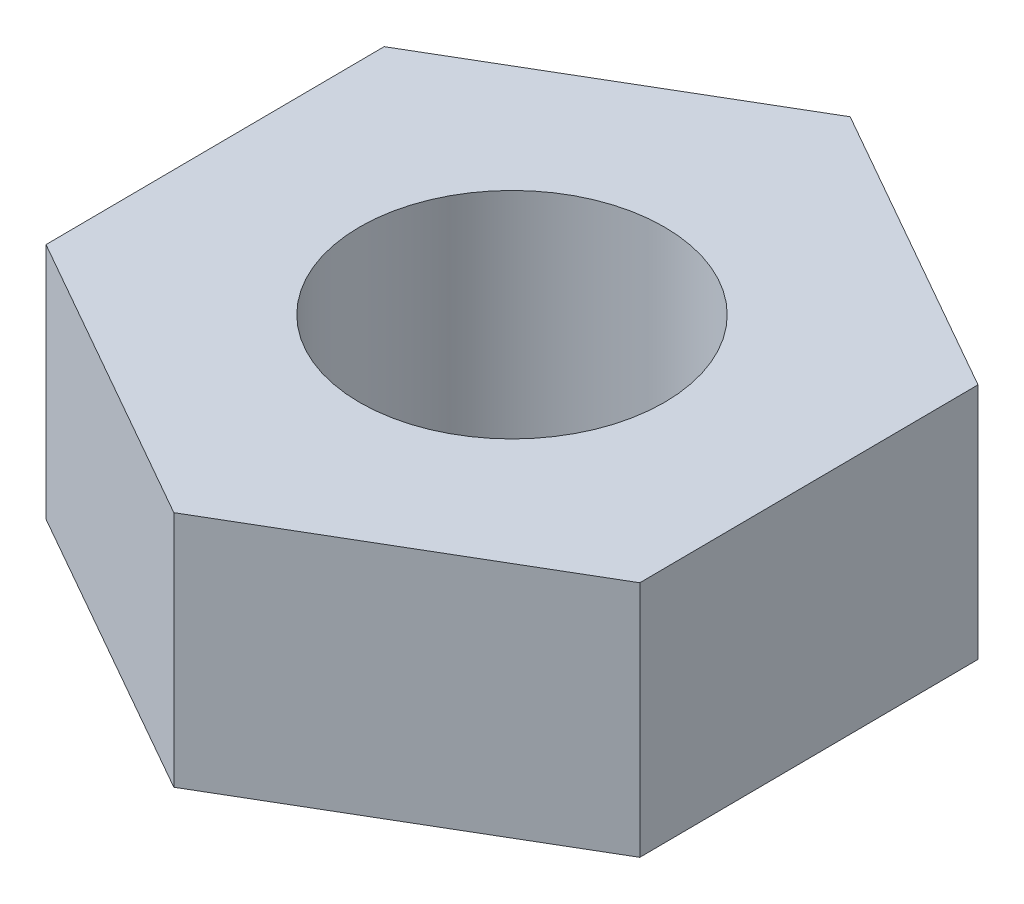
ISO-10303-21;
HEADER;
FILE_DESCRIPTION(('STEP AP214'),'2;1');
FILE_NAME('part.step','',(''),(''),'','','');
FILE_SCHEMA(('AUTOMOTIVE_DESIGN { 1 0 10303 214 1 1 1 1 }'));
ENDSEC;
DATA;
#1=APPLICATION_CONTEXT('core data for automotive mechanical design processes');
#2=APPLICATION_PROTOCOL_DEFINITION('international standard','automotive_design',2000,#1);
#3=PRODUCT_CONTEXT('',#1,'mechanical');
#4=PRODUCT('Part','Part','',(#3));
#5=PRODUCT_RELATED_PRODUCT_CATEGORY('part','',(#4));
#6=PRODUCT_DEFINITION_FORMATION('','',#4);
#7=PRODUCT_DEFINITION_CONTEXT('part definition',#1,'design');
#8=PRODUCT_DEFINITION('design','',#6,#7);
#9=PRODUCT_DEFINITION_SHAPE('','',#8);
#10=(LENGTH_UNIT() NAMED_UNIT(*) SI_UNIT(.MILLI.,.METRE.));
#11=(NAMED_UNIT(*) PLANE_ANGLE_UNIT() SI_UNIT($,.RADIAN.));
#12=(NAMED_UNIT(*) SI_UNIT($,.STERADIAN.) SOLID_ANGLE_UNIT());
#13=UNCERTAINTY_MEASURE_WITH_UNIT(LENGTH_MEASURE(1.E-05),#10,'distance_accuracy_value','');
#14=(GEOMETRIC_REPRESENTATION_CONTEXT(3) GLOBAL_UNCERTAINTY_ASSIGNED_CONTEXT((#13)) GLOBAL_UNIT_ASSIGNED_CONTEXT((#10,
#11,#12)) REPRESENTATION_CONTEXT('',''));
#15=CARTESIAN_POINT('',(0.,0.,0.));
#16=DIRECTION('',(0.,0.,1.));
#17=DIRECTION('',(1.,0.,0.));
#18=AXIS2_PLACEMENT_3D('',#15,#16,#17);
#19=CARTESIAN_POINT('',(3.89035270259153,3.125,2.21042737559322));
#20=DIRECTION('',(0.,-1.,0.));
#21=DIRECTION('',(0.,0.,-1.));
#22=AXIS2_PLACEMENT_3D('',#19,#20,#21);
#23=PLANE('',#22);
#24=DIRECTION('',(-0.00690363957882424,0.,-0.999976169596339));
#25=VECTOR('',#24,1.);
#26=CARTESIAN_POINT('',(3.89035270259153,3.125,2.21042737559322));
#27=LINE('',#26,#25);
#28=CARTESIAN_POINT('',(3.89035270259153,3.125,2.21042737559322));
#29=VERTEX_POINT('',#28);
#30=CARTESIAN_POINT('',(3.85946261178006,3.125,-2.2639305823291));
#31=VERTEX_POINT('',#30);
#32=EDGE_CURVE('E118',#29,#31,#27,.T.);
#33=ORIENTED_EDGE('',*,*,#32,.T.);
#34=DIRECTION('',(-0.869456585838897,0.,-0.494009357544337));
#35=VECTOR('',#34,1.);
#36=CARTESIAN_POINT('',(3.85946261178006,3.125,-2.2639305823291));
#37=LINE('',#36,#35);
#38=CARTESIAN_POINT('',(-0.0308900908114723,3.125,-4.47435795792232));
#39=VERTEX_POINT('',#38);
#40=EDGE_CURVE('E99',#31,#39,#37,.T.);
#41=ORIENTED_EDGE('',*,*,#40,.T.);
#42=DIRECTION('',(-0.862552946260073,0.,0.505966812052003));
#43=VECTOR('',#42,1.);
#44=CARTESIAN_POINT('',(-0.0308900908114723,3.125,-4.47435795792232));
#45=LINE('',#44,#43);
#46=CARTESIAN_POINT('',(-3.89035270259153,3.125,-2.21042737559322));
#47=VERTEX_POINT('',#46);
#48=EDGE_CURVE('E121',#39,#47,#45,.T.);
#49=ORIENTED_EDGE('',*,*,#48,.T.);
#50=DIRECTION('',(0.00690363957882444,0.,0.999976169596339));
#51=VECTOR('',#50,1.);
#52=CARTESIAN_POINT('',(-3.89035270259153,3.125,-2.21042737559322));
#53=LINE('',#52,#51);
#54=CARTESIAN_POINT('',(-3.85946261178006,3.125,2.2639305823291));
#55=VERTEX_POINT('',#54);
#56=EDGE_CURVE('E123',#47,#55,#53,.T.);
#57=ORIENTED_EDGE('',*,*,#56,.T.);
#58=DIRECTION('',(0.869456585838897,0.,0.494009357544337));
#59=VECTOR('',#58,1.);
#60=CARTESIAN_POINT('',(-3.85946261178006,3.125,2.2639305823291));
#61=LINE('',#60,#59);
#62=CARTESIAN_POINT('',(0.0308900908114716,3.125,4.47435795792233));
#63=VERTEX_POINT('',#62);
#64=EDGE_CURVE('E52',#55,#63,#61,.T.);
#65=ORIENTED_EDGE('',*,*,#64,.T.);
#66=DIRECTION('',(0.862552946260074,0.,-0.505966812052003));
#67=VECTOR('',#66,1.);
#68=CARTESIAN_POINT('',(0.0308900908114716,3.125,4.47435795792233));
#69=LINE('',#68,#67);
#70=EDGE_CURVE('E47',#63,#29,#69,.T.);
#71=ORIENTED_EDGE('',*,*,#70,.T.);
#72=EDGE_LOOP('',(#33,#41,#49,#57,#65,#71));
#73=FACE_BOUND('',#72,.T.);
#74=CARTESIAN_POINT('',(0.,3.125,0.));
#75=DIRECTION('',(0.,1.,0.));
#76=DIRECTION('',(0.,0.,1.));
#77=AXIS2_PLACEMENT_3D('',#74,#75,#76);
#78=CIRCLE('',#77,2.);
#79=CARTESIAN_POINT('',(0.,3.125,2.));
#80=VERTEX_POINT('',#79);
#81=EDGE_CURVE('E104',#80,#80,#78,.T.);
#82=ORIENTED_EDGE('',*,*,#81,.F.);
#83=EDGE_LOOP('',(#82));
#84=FACE_BOUND('',#83,.T.);
#85=ADVANCED_FACE('F32',(#73,#84),#23,.F.);
#86=CARTESIAN_POINT('',(3.89035270259153,0.,2.21042737559322));
#87=DIRECTION('',(0.,-1.,0.));
#88=DIRECTION('',(0.,0.,-1.));
#89=AXIS2_PLACEMENT_3D('',#86,#87,#88);
#90=PLANE('',#89);
#91=DIRECTION('',(-0.00690363957882424,0.,-0.999976169596339));
#92=VECTOR('',#91,1.);
#93=CARTESIAN_POINT('',(3.89035270259153,0.,2.21042737559322));
#94=LINE('',#93,#92);
#95=CARTESIAN_POINT('',(3.89035270259153,0.,2.21042737559322));
#96=VERTEX_POINT('',#95);
#97=CARTESIAN_POINT('',(3.85946261178006,0.,-2.2639305823291));
#98=VERTEX_POINT('',#97);
#99=EDGE_CURVE('E90',#96,#98,#94,.T.);
#100=ORIENTED_EDGE('',*,*,#99,.F.);
#101=DIRECTION('',(0.862552946260074,0.,-0.505966812052003));
#102=VECTOR('',#101,1.);
#103=CARTESIAN_POINT('',(0.0308900908114716,0.,4.47435795792233));
#104=LINE('',#103,#102);
#105=CARTESIAN_POINT('',(0.0308900908114716,0.,4.47435795792233));
#106=VERTEX_POINT('',#105);
#107=EDGE_CURVE('E116',#106,#96,#104,.T.);
#108=ORIENTED_EDGE('',*,*,#107,.F.);
#109=DIRECTION('',(0.869456585838897,0.,0.494009357544337));
#110=VECTOR('',#109,1.);
#111=CARTESIAN_POINT('',(-3.85946261178006,0.,2.2639305823291));
#112=LINE('',#111,#110);
#113=CARTESIAN_POINT('',(-3.85946261178006,0.,2.2639305823291));
#114=VERTEX_POINT('',#113);
#115=EDGE_CURVE('E114',#114,#106,#112,.T.);
#116=ORIENTED_EDGE('',*,*,#115,.F.);
#117=DIRECTION('',(0.00690363957882444,0.,0.999976169596339));
#118=VECTOR('',#117,1.);
#119=CARTESIAN_POINT('',(-3.89035270259153,0.,-2.21042737559322));
#120=LINE('',#119,#118);
#121=CARTESIAN_POINT('',(-3.89035270259153,0.,-2.21042737559322));
#122=VERTEX_POINT('',#121);
#123=EDGE_CURVE('E112',#122,#114,#120,.T.);
#124=ORIENTED_EDGE('',*,*,#123,.F.);
#125=DIRECTION('',(-0.862552946260073,0.,0.505966812052003));
#126=VECTOR('',#125,1.);
#127=CARTESIAN_POINT('',(-0.0308900908114723,0.,-4.47435795792232));
#128=LINE('',#127,#126);
#129=CARTESIAN_POINT('',(-0.0308900908114723,0.,-4.47435795792232));
#130=VERTEX_POINT('',#129);
#131=EDGE_CURVE('E92',#130,#122,#128,.T.);
#132=ORIENTED_EDGE('',*,*,#131,.F.);
#133=DIRECTION('',(-0.869456585838897,0.,-0.494009357544337));
#134=VECTOR('',#133,1.);
#135=CARTESIAN_POINT('',(3.85946261178006,0.,-2.2639305823291));
#136=LINE('',#135,#134);
#137=EDGE_CURVE('E85',#98,#130,#136,.T.);
#138=ORIENTED_EDGE('',*,*,#137,.F.);
#139=EDGE_LOOP('',(#100,#108,#116,#124,#132,#138));
#140=FACE_BOUND('',#139,.T.);
#141=CARTESIAN_POINT('',(0.,0.,0.));
#142=DIRECTION('',(0.,1.,0.));
#143=DIRECTION('',(0.,0.,1.));
#144=AXIS2_PLACEMENT_3D('',#141,#142,#143);
#145=CIRCLE('',#144,2.);
#146=CARTESIAN_POINT('',(0.,0.,2.));
#147=VERTEX_POINT('',#146);
#148=EDGE_CURVE('E107',#147,#147,#145,.T.);
#149=ORIENTED_EDGE('',*,*,#148,.T.);
#150=EDGE_LOOP('',(#149));
#151=FACE_BOUND('',#150,.T.);
#152=ADVANCED_FACE('F86',(#140,#151),#90,.T.);
#153=CARTESIAN_POINT('',(3.89035270259153,3.125,2.21042737559322));
#154=DIRECTION('',(-0.999976169596339,0.,0.00690363957882425));
#155=DIRECTION('',(0.00690363957882425,0.,0.999976169596339));
#156=AXIS2_PLACEMENT_3D('',#153,#154,#155);
#157=PLANE('',#156);
#158=ORIENTED_EDGE('',*,*,#99,.T.);
#159=DIRECTION('',(0.,-1.,0.));
#160=VECTOR('',#159,1.);
#161=CARTESIAN_POINT('',(3.85946261178006,3.125,-2.2639305823291));
#162=LINE('',#161,#160);
#163=EDGE_CURVE('E11',#31,#98,#162,.T.);
#164=ORIENTED_EDGE('',*,*,#163,.F.);
#165=ORIENTED_EDGE('',*,*,#32,.F.);
#166=DIRECTION('',(0.,-1.,0.));
#167=VECTOR('',#166,1.);
#168=CARTESIAN_POINT('',(3.89035270259153,3.125,2.21042737559322));
#169=LINE('',#168,#167);
#170=EDGE_CURVE('E103',#29,#96,#169,.T.);
#171=ORIENTED_EDGE('',*,*,#170,.T.);
#172=EDGE_LOOP('',(#158,#164,#165,#171));
#173=FACE_BOUND('',#172,.T.);
#174=ADVANCED_FACE('F34',(#173),#157,.F.);
#175=CARTESIAN_POINT('',(3.85946261178006,3.125,-2.2639305823291));
#176=DIRECTION('',(-0.494009357544337,0.,0.869456585838898));
#177=DIRECTION('',(0.869456585838898,0.,0.494009357544337));
#178=AXIS2_PLACEMENT_3D('',#175,#176,#177);
#179=PLANE('',#178);
#180=ORIENTED_EDGE('',*,*,#137,.T.);
#181=DIRECTION('',(0.,-1.,0.));
#182=VECTOR('',#181,1.);
#183=CARTESIAN_POINT('',(-0.0308900908114723,3.125,-4.47435795792232));
#184=LINE('',#183,#182);
#185=EDGE_CURVE('E40',#39,#130,#184,.T.);
#186=ORIENTED_EDGE('',*,*,#185,.F.);
#187=ORIENTED_EDGE('',*,*,#40,.F.);
#188=ORIENTED_EDGE('',*,*,#163,.T.);
#189=EDGE_LOOP('',(#180,#186,#187,#188));
#190=FACE_BOUND('',#189,.T.);
#191=ADVANCED_FACE('F98',(#190),#179,.F.);
#192=CARTESIAN_POINT('',(-0.0308900908114723,3.125,-4.47435795792232));
#193=DIRECTION('',(0.505966812052003,0.,0.862552946260073));
#194=DIRECTION('',(0.862552946260073,0.,-0.505966812052003));
#195=AXIS2_PLACEMENT_3D('',#192,#193,#194);
#196=PLANE('',#195);
#197=ORIENTED_EDGE('',*,*,#131,.T.);
#198=DIRECTION('',(0.,-1.,0.));
#199=VECTOR('',#198,1.);
#200=CARTESIAN_POINT('',(-3.89035270259153,3.125,-2.21042737559322));
#201=LINE('',#200,#199);
#202=EDGE_CURVE('E134',#47,#122,#201,.T.);
#203=ORIENTED_EDGE('',*,*,#202,.F.);
#204=ORIENTED_EDGE('',*,*,#48,.F.);
#205=ORIENTED_EDGE('',*,*,#185,.T.);
#206=EDGE_LOOP('',(#197,#203,#204,#205));
#207=FACE_BOUND('',#206,.T.);
#208=ADVANCED_FACE('F138',(#207),#196,.F.);
#209=CARTESIAN_POINT('',(-3.89035270259153,3.125,-2.21042737559322));
#210=DIRECTION('',(0.999976169596339,0.,-0.00690363957882444));
#211=DIRECTION('',(-0.00690363957882444,0.,-0.999976169596339));
#212=AXIS2_PLACEMENT_3D('',#209,#210,#211);
#213=PLANE('',#212);
#214=ORIENTED_EDGE('',*,*,#123,.T.);
#215=DIRECTION('',(0.,-1.,0.));
#216=VECTOR('',#215,1.);
#217=CARTESIAN_POINT('',(-3.85946261178006,3.125,2.2639305823291));
#218=LINE('',#217,#216);
#219=EDGE_CURVE('E131',#55,#114,#218,.T.);
#220=ORIENTED_EDGE('',*,*,#219,.F.);
#221=ORIENTED_EDGE('',*,*,#56,.F.);
#222=ORIENTED_EDGE('',*,*,#202,.T.);
#223=EDGE_LOOP('',(#214,#220,#221,#222));
#224=FACE_BOUND('',#223,.T.);
#225=ADVANCED_FACE('F144',(#224),#213,.F.);
#226=CARTESIAN_POINT('',(-3.85946261178006,3.125,2.2639305823291));
#227=DIRECTION('',(0.494009357544337,0.,-0.869456585838897));
#228=DIRECTION('',(-0.869456585838897,0.,-0.494009357544337));
#229=AXIS2_PLACEMENT_3D('',#226,#227,#228);
#230=PLANE('',#229);
#231=ORIENTED_EDGE('',*,*,#115,.T.);
#232=DIRECTION('',(0.,-1.,0.));
#233=VECTOR('',#232,1.);
#234=CARTESIAN_POINT('',(0.0308900908114716,3.125,4.47435795792233));
#235=LINE('',#234,#233);
#236=EDGE_CURVE('E128',#63,#106,#235,.T.);
#237=ORIENTED_EDGE('',*,*,#236,.F.);
#238=ORIENTED_EDGE('',*,*,#64,.F.);
#239=ORIENTED_EDGE('',*,*,#219,.T.);
#240=EDGE_LOOP('',(#231,#237,#238,#239));
#241=FACE_BOUND('',#240,.T.);
#242=ADVANCED_FACE('F147',(#241),#230,.F.);
#243=CARTESIAN_POINT('',(0.0308900908114716,3.125,4.47435795792233));
#244=DIRECTION('',(-0.505966812052003,0.,-0.862552946260074));
#245=DIRECTION('',(-0.862552946260074,0.,0.505966812052003));
#246=AXIS2_PLACEMENT_3D('',#243,#244,#245);
#247=PLANE('',#246);
#248=ORIENTED_EDGE('',*,*,#107,.T.);
#249=ORIENTED_EDGE('',*,*,#170,.F.);
#250=ORIENTED_EDGE('',*,*,#70,.F.);
#251=ORIENTED_EDGE('',*,*,#236,.T.);
#252=EDGE_LOOP('',(#248,#249,#250,#251));
#253=FACE_BOUND('',#252,.T.);
#254=ADVANCED_FACE('F149',(#253),#247,.F.);
#255=CARTESIAN_POINT('',(0.,3.125,0.));
#256=DIRECTION('',(0.,-1.,0.));
#257=DIRECTION('',(0.,0.,-1.));
#258=AXIS2_PLACEMENT_3D('',#255,#256,#257);
#259=CYLINDRICAL_SURFACE('',#258,2.);
#260=ORIENTED_EDGE('',*,*,#81,.T.);
#261=EDGE_LOOP('',(#260));
#262=FACE_BOUND('',#261,.T.);
#263=ORIENTED_EDGE('',*,*,#148,.F.);
#264=EDGE_LOOP('',(#263));
#265=FACE_BOUND('',#264,.T.);
#266=ADVANCED_FACE('F151',(#262,#265),#259,.F.);
#267=CLOSED_SHELL('',(#85,#152,#174,#191,#208,#225,#242,#254,#266));
#268=MANIFOLD_SOLID_BREP('B2',#267);
#269=ADVANCED_BREP_SHAPE_REPRESENTATION('',(#18,#268),#14);
#270=SHAPE_DEFINITION_REPRESENTATION(#9,#269);
ENDSEC;
END-ISO-10303-21;
